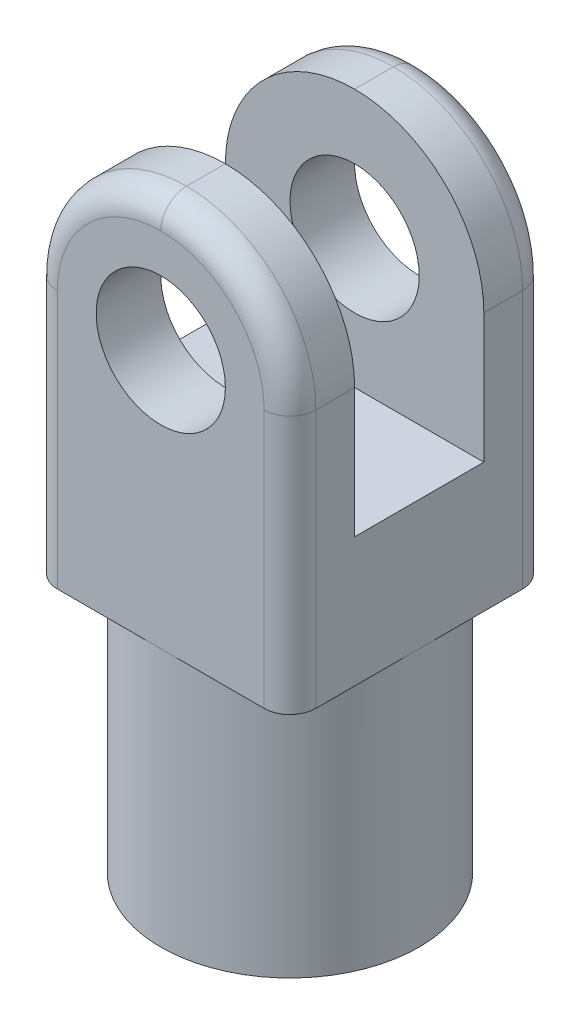
ISO-10303-21;
HEADER;
FILE_DESCRIPTION(('STEP AP214'),'2;1');
FILE_NAME('part.step','',(''),(''),'','','');
FILE_SCHEMA(('AUTOMOTIVE_DESIGN { 1 0 10303 214 1 1 1 1 }'));
ENDSEC;
DATA;
#1=APPLICATION_CONTEXT('core data for automotive mechanical design processes');
#2=APPLICATION_PROTOCOL_DEFINITION('international standard','automotive_design',2000,#1);
#3=PRODUCT_CONTEXT('',#1,'mechanical');
#4=PRODUCT('Part','Part','',(#3));
#5=PRODUCT_RELATED_PRODUCT_CATEGORY('part','',(#4));
#6=PRODUCT_DEFINITION_FORMATION('','',#4);
#7=PRODUCT_DEFINITION_CONTEXT('part definition',#1,'design');
#8=PRODUCT_DEFINITION('design','',#6,#7);
#9=PRODUCT_DEFINITION_SHAPE('','',#8);
#10=(LENGTH_UNIT() NAMED_UNIT(*) SI_UNIT(.MILLI.,.METRE.));
#11=(NAMED_UNIT(*) PLANE_ANGLE_UNIT() SI_UNIT($,.RADIAN.));
#12=(NAMED_UNIT(*) SI_UNIT($,.STERADIAN.) SOLID_ANGLE_UNIT());
#13=UNCERTAINTY_MEASURE_WITH_UNIT(LENGTH_MEASURE(1.E-05),#10,'distance_accuracy_value','');
#14=(GEOMETRIC_REPRESENTATION_CONTEXT(3) GLOBAL_UNCERTAINTY_ASSIGNED_CONTEXT((#13)) GLOBAL_UNIT_ASSIGNED_CONTEXT((#10,
#11,#12)) REPRESENTATION_CONTEXT('',''));
#15=CARTESIAN_POINT('',(0.,0.,0.));
#16=DIRECTION('',(0.,0.,1.));
#17=DIRECTION('',(1.,0.,0.));
#18=AXIS2_PLACEMENT_3D('',#15,#16,#17);
#19=CARTESIAN_POINT('',(0.,0.,0.));
#20=DIRECTION('',(0.,1.,0.));
#21=DIRECTION('',(0.,0.,1.));
#22=AXIS2_PLACEMENT_3D('',#19,#20,#21);
#23=PLANE('',#22);
#24=DIRECTION('',(-1.,0.,0.));
#25=VECTOR('',#24,1.);
#26=CARTESIAN_POINT('',(-50.,0.,-50.));
#27=LINE('',#26,#25);
#28=CARTESIAN_POINT('',(40.,0.,-50.));
#29=VERTEX_POINT('',#28);
#30=CARTESIAN_POINT('',(0.,0.,-50.));
#31=VERTEX_POINT('',#30);
#32=EDGE_CURVE('E224',#29,#31,#27,.T.);
#33=ORIENTED_EDGE('',*,*,#32,.F.);
#34=CARTESIAN_POINT('',(40.,0.,-40.));
#35=DIRECTION('',(0.,1.,0.));
#36=DIRECTION('',(0.,0.,1.));
#37=AXIS2_PLACEMENT_3D('',#34,#35,#36);
#38=CIRCLE('',#37,10.);
#39=CARTESIAN_POINT('',(50.,0.,-40.));
#40=VERTEX_POINT('',#39);
#41=EDGE_CURVE('E65',#29,#40,#38,.F.);
#42=ORIENTED_EDGE('',*,*,#41,.T.);
#43=DIRECTION('',(0.,0.,-1.));
#44=VECTOR('',#43,1.);
#45=CARTESIAN_POINT('',(50.,0.,-50.));
#46=LINE('',#45,#44);
#47=CARTESIAN_POINT('',(50.,0.,0.));
#48=VERTEX_POINT('',#47);
#49=EDGE_CURVE('E214',#48,#40,#46,.T.);
#50=ORIENTED_EDGE('',*,*,#49,.F.);
#51=CARTESIAN_POINT('',(0.,0.,0.));
#52=DIRECTION('',(0.,-1.,0.));
#53=DIRECTION('',(0.,0.,-1.));
#54=AXIS2_PLACEMENT_3D('',#51,#52,#53);
#55=CIRCLE('',#54,50.);
#56=EDGE_CURVE('E204',#31,#48,#55,.T.);
#57=ORIENTED_EDGE('',*,*,#56,.F.);
#58=EDGE_LOOP('',(#33,#42,#50,#57));
#59=FACE_BOUND('',#58,.T.);
#60=ADVANCED_FACE('F39',(#59),#23,.F.);
#61=CARTESIAN_POINT('',(50.,0.,40.));
#62=VERTEX_POINT('',#61);
#63=EDGE_CURVE('E220',#62,#48,#46,.T.);
#64=ORIENTED_EDGE('',*,*,#63,.F.);
#65=CARTESIAN_POINT('',(40.,0.,40.));
#66=DIRECTION('',(0.,1.,0.));
#67=DIRECTION('',(0.,0.,1.));
#68=AXIS2_PLACEMENT_3D('',#65,#66,#67);
#69=CIRCLE('',#68,10.);
#70=CARTESIAN_POINT('',(40.,0.,50.));
#71=VERTEX_POINT('',#70);
#72=EDGE_CURVE('E11',#62,#71,#69,.F.);
#73=ORIENTED_EDGE('',*,*,#72,.T.);
#74=DIRECTION('',(1.,0.,0.));
#75=VECTOR('',#74,1.);
#76=CARTESIAN_POINT('',(-50.,0.,50.));
#77=LINE('',#76,#75);
#78=CARTESIAN_POINT('',(0.,0.,50.));
#79=VERTEX_POINT('',#78);
#80=EDGE_CURVE('E231',#79,#71,#77,.T.);
#81=ORIENTED_EDGE('',*,*,#80,.F.);
#82=EDGE_CURVE('E218',#48,#79,#55,.T.);
#83=ORIENTED_EDGE('',*,*,#82,.F.);
#84=EDGE_LOOP('',(#64,#73,#81,#83));
#85=FACE_BOUND('',#84,.T.);
#86=ADVANCED_FACE('F363',(#85),#23,.F.);
#87=CARTESIAN_POINT('',(-40.,0.,50.));
#88=VERTEX_POINT('',#87);
#89=EDGE_CURVE('E232',#88,#79,#77,.T.);
#90=ORIENTED_EDGE('',*,*,#89,.F.);
#91=CARTESIAN_POINT('',(-40.,0.,40.));
#92=DIRECTION('',(0.,1.,0.));
#93=DIRECTION('',(0.,0.,1.));
#94=AXIS2_PLACEMENT_3D('',#91,#92,#93);
#95=CIRCLE('',#94,10.);
#96=CARTESIAN_POINT('',(-50.,0.,40.));
#97=VERTEX_POINT('',#96);
#98=EDGE_CURVE('E314',#88,#97,#95,.F.);
#99=ORIENTED_EDGE('',*,*,#98,.T.);
#100=DIRECTION('',(0.,0.,1.));
#101=VECTOR('',#100,1.);
#102=CARTESIAN_POINT('',(-50.,0.,-50.));
#103=LINE('',#102,#101);
#104=CARTESIAN_POINT('',(-50.,0.,0.));
#105=VERTEX_POINT('',#104);
#106=EDGE_CURVE('E227',#105,#97,#103,.T.);
#107=ORIENTED_EDGE('',*,*,#106,.F.);
#108=EDGE_CURVE('E665',#79,#105,#55,.T.);
#109=ORIENTED_EDGE('',*,*,#108,.F.);
#110=EDGE_LOOP('',(#90,#99,#107,#109));
#111=FACE_BOUND('',#110,.T.);
#112=ADVANCED_FACE('F421',(#111),#23,.F.);
#113=CARTESIAN_POINT('',(50.,150.,-50.));
#114=DIRECTION('',(-1.,0.,0.));
#115=DIRECTION('',(0.,0.,1.));
#116=AXIS2_PLACEMENT_3D('',#113,#114,#115);
#117=PLANE('',#116);
#118=ORIENTED_EDGE('',*,*,#49,.T.);
#119=DIRECTION('',(0.,-1.,0.));
#120=VECTOR('',#119,1.);
#121=CARTESIAN_POINT('',(50.,150.,-40.));
#122=LINE('',#121,#120);
#123=CARTESIAN_POINT('',(50.,100.,-40.));
#124=VERTEX_POINT('',#123);
#125=EDGE_CURVE('E49',#40,#124,#122,.F.);
#126=ORIENTED_EDGE('',*,*,#125,.T.);
#127=DIRECTION('',(0.,0.,-1.));
#128=VECTOR('',#127,1.);
#129=CARTESIAN_POINT('',(50.,100.,-25.));
#130=LINE('',#129,#128);
#131=CARTESIAN_POINT('',(50.,100.,-25.));
#132=VERTEX_POINT('',#131);
#133=EDGE_CURVE('E246',#124,#132,#130,.F.);
#134=ORIENTED_EDGE('',*,*,#133,.T.);
#135=DIRECTION('',(0.,1.,0.));
#136=VECTOR('',#135,1.);
#137=CARTESIAN_POINT('',(50.,50.,-25.));
#138=LINE('',#137,#136);
#139=CARTESIAN_POINT('',(50.,50.,-25.));
#140=VERTEX_POINT('',#139);
#141=EDGE_CURVE('E195',#140,#132,#138,.T.);
#142=ORIENTED_EDGE('',*,*,#141,.F.);
#143=DIRECTION('',(0.,0.,-1.));
#144=VECTOR('',#143,1.);
#145=CARTESIAN_POINT('',(50.,50.,-25.));
#146=LINE('',#145,#144);
#147=CARTESIAN_POINT('',(50.,50.,25.));
#148=VERTEX_POINT('',#147);
#149=EDGE_CURVE('E174',#148,#140,#146,.T.);
#150=ORIENTED_EDGE('',*,*,#149,.F.);
#151=DIRECTION('',(0.,1.,0.));
#152=VECTOR('',#151,1.);
#153=CARTESIAN_POINT('',(50.,50.,25.));
#154=LINE('',#153,#152);
#155=CARTESIAN_POINT('',(50.,100.,25.));
#156=VERTEX_POINT('',#155);
#157=EDGE_CURVE('E170',#148,#156,#154,.T.);
#158=ORIENTED_EDGE('',*,*,#157,.T.);
#159=DIRECTION('',(0.,0.,-1.));
#160=VECTOR('',#159,1.);
#161=CARTESIAN_POINT('',(50.,100.,50.));
#162=LINE('',#161,#160);
#163=CARTESIAN_POINT('',(50.,100.,40.));
#164=VERTEX_POINT('',#163);
#165=EDGE_CURVE('E249',#156,#164,#162,.F.);
#166=ORIENTED_EDGE('',*,*,#165,.T.);
#167=DIRECTION('',(0.,-1.,0.));
#168=VECTOR('',#167,1.);
#169=CARTESIAN_POINT('',(50.,150.,40.));
#170=LINE('',#169,#168);
#171=EDGE_CURVE('E57',#164,#62,#170,.T.);
#172=ORIENTED_EDGE('',*,*,#171,.T.);
#173=ORIENTED_EDGE('',*,*,#63,.T.);
#174=EDGE_LOOP('',(#118,#126,#134,#142,#150,#158,#166,#172,#173));
#175=FACE_BOUND('',#174,.T.);
#176=ADVANCED_FACE('F467',(#175),#117,.F.);
#177=CARTESIAN_POINT('',(-50.,150.,-50.));
#178=DIRECTION('',(0.,0.,1.));
#179=DIRECTION('',(1.,0.,0.));
#180=AXIS2_PLACEMENT_3D('',#177,#178,#179);
#181=PLANE('',#180);
#182=CARTESIAN_POINT('',(0.,100.,-50.));
#183=DIRECTION('',(0.,0.,1.));
#184=DIRECTION('',(1.,0.,0.));
#185=AXIS2_PLACEMENT_3D('',#182,#183,#184);
#186=CIRCLE('',#185,25.);
#187=CARTESIAN_POINT('',(25.,100.,-50.));
#188=VERTEX_POINT('',#187);
#189=EDGE_CURVE('E239',#188,#188,#186,.T.);
#190=ORIENTED_EDGE('',*,*,#189,.T.);
#191=EDGE_LOOP('',(#190));
#192=FACE_BOUND('',#191,.T.);
#193=CARTESIAN_POINT('',(-40.,0.,-50.));
#194=VERTEX_POINT('',#193);
#195=EDGE_CURVE('E223',#31,#194,#27,.T.);
#196=ORIENTED_EDGE('',*,*,#195,.T.);
#197=DIRECTION('',(0.,-1.,0.));
#198=VECTOR('',#197,1.);
#199=CARTESIAN_POINT('',(-40.,150.,-50.));
#200=LINE('',#199,#198);
#201=CARTESIAN_POINT('',(-40.,100.,-50.));
#202=VERTEX_POINT('',#201);
#203=EDGE_CURVE('E292',#194,#202,#200,.F.);
#204=ORIENTED_EDGE('',*,*,#203,.T.);
#205=CARTESIAN_POINT('',(0.,100.,-50.));
#206=DIRECTION('',(0.,0.,1.));
#207=DIRECTION('',(1.,0.,0.));
#208=AXIS2_PLACEMENT_3D('',#205,#206,#207);
#209=CIRCLE('',#208,40.);
#210=CARTESIAN_POINT('',(0.,140.,-50.));
#211=VERTEX_POINT('',#210);
#212=EDGE_CURVE('E289',#202,#211,#209,.F.);
#213=ORIENTED_EDGE('',*,*,#212,.T.);
#214=CARTESIAN_POINT('',(0.,100.,-50.));
#215=DIRECTION('',(0.,0.,1.));
#216=DIRECTION('',(1.,0.,0.));
#217=AXIS2_PLACEMENT_3D('',#214,#215,#216);
#218=CIRCLE('',#217,40.);
#219=CARTESIAN_POINT('',(40.,100.,-50.));
#220=VERTEX_POINT('',#219);
#221=EDGE_CURVE('E286',#211,#220,#218,.F.);
#222=ORIENTED_EDGE('',*,*,#221,.T.);
#223=DIRECTION('',(0.,-1.,0.));
#224=VECTOR('',#223,1.);
#225=CARTESIAN_POINT('',(40.,150.,-50.));
#226=LINE('',#225,#224);
#227=EDGE_CURVE('E283',#220,#29,#226,.T.);
#228=ORIENTED_EDGE('',*,*,#227,.T.);
#229=ORIENTED_EDGE('',*,*,#32,.T.);
#230=EDGE_LOOP('',(#196,#204,#213,#222,#228,#229));
#231=FACE_BOUND('',#230,.T.);
#232=ADVANCED_FACE('F396',(#192,#231),#181,.F.);
#233=CARTESIAN_POINT('',(-50.,150.,-50.));
#234=DIRECTION('',(1.,0.,0.));
#235=DIRECTION('',(0.,0.,-1.));
#236=AXIS2_PLACEMENT_3D('',#233,#234,#235);
#237=PLANE('',#236);
#238=DIRECTION('',(0.,0.,1.));
#239=VECTOR('',#238,1.);
#240=CARTESIAN_POINT('',(-50.,100.,-50.));
#241=LINE('',#240,#239);
#242=CARTESIAN_POINT('',(-50.,100.,-25.));
#243=VERTEX_POINT('',#242);
#244=CARTESIAN_POINT('',(-50.,100.,-40.));
#245=VERTEX_POINT('',#244);
#246=EDGE_CURVE('E261',#243,#245,#241,.F.);
#247=ORIENTED_EDGE('',*,*,#246,.T.);
#248=DIRECTION('',(0.,-1.,0.));
#249=VECTOR('',#248,1.);
#250=CARTESIAN_POINT('',(-50.,150.,-40.));
#251=LINE('',#250,#249);
#252=CARTESIAN_POINT('',(-50.,0.,-40.));
#253=VERTEX_POINT('',#252);
#254=EDGE_CURVE('E276',#245,#253,#251,.T.);
#255=ORIENTED_EDGE('',*,*,#254,.T.);
#256=EDGE_CURVE('E228',#253,#105,#103,.T.);
#257=ORIENTED_EDGE('',*,*,#256,.T.);
#258=ORIENTED_EDGE('',*,*,#106,.T.);
#259=DIRECTION('',(0.,-1.,0.));
#260=VECTOR('',#259,1.);
#261=CARTESIAN_POINT('',(-50.,150.,40.));
#262=LINE('',#261,#260);
#263=CARTESIAN_POINT('',(-50.,100.,40.));
#264=VERTEX_POINT('',#263);
#265=EDGE_CURVE('E264',#97,#264,#262,.F.);
#266=ORIENTED_EDGE('',*,*,#265,.T.);
#267=DIRECTION('',(0.,0.,1.));
#268=VECTOR('',#267,1.);
#269=CARTESIAN_POINT('',(-50.,100.,25.));
#270=LINE('',#269,#268);
#271=CARTESIAN_POINT('',(-50.,100.,25.));
#272=VERTEX_POINT('',#271);
#273=EDGE_CURVE('E190',#264,#272,#270,.F.);
#274=ORIENTED_EDGE('',*,*,#273,.T.);
#275=DIRECTION('',(0.,1.,0.));
#276=VECTOR('',#275,1.);
#277=CARTESIAN_POINT('',(-50.,50.,25.));
#278=LINE('',#277,#276);
#279=CARTESIAN_POINT('',(-50.,50.,25.));
#280=VERTEX_POINT('',#279);
#281=EDGE_CURVE('E167',#280,#272,#278,.T.);
#282=ORIENTED_EDGE('',*,*,#281,.F.);
#283=DIRECTION('',(0.,0.,1.));
#284=VECTOR('',#283,1.);
#285=CARTESIAN_POINT('',(-50.,50.,-25.));
#286=LINE('',#285,#284);
#287=CARTESIAN_POINT('',(-50.,50.,-25.));
#288=VERTEX_POINT('',#287);
#289=EDGE_CURVE('E175',#288,#280,#286,.T.);
#290=ORIENTED_EDGE('',*,*,#289,.F.);
#291=DIRECTION('',(0.,1.,0.));
#292=VECTOR('',#291,1.);
#293=CARTESIAN_POINT('',(-50.,50.,-25.));
#294=LINE('',#293,#292);
#295=EDGE_CURVE('E209',#288,#243,#294,.T.);
#296=ORIENTED_EDGE('',*,*,#295,.T.);
#297=EDGE_LOOP('',(#247,#255,#257,#258,#266,#274,#282,#290,#296));
#298=FACE_BOUND('',#297,.T.);
#299=ADVANCED_FACE('F188',(#298),#237,.F.);
#300=CARTESIAN_POINT('',(-50.,150.,50.));
#301=DIRECTION('',(0.,0.,-1.));
#302=DIRECTION('',(-1.,0.,0.));
#303=AXIS2_PLACEMENT_3D('',#300,#301,#302);
#304=PLANE('',#303);
#305=CARTESIAN_POINT('',(0.,100.,50.));
#306=DIRECTION('',(0.,0.,1.));
#307=DIRECTION('',(1.,0.,0.));
#308=AXIS2_PLACEMENT_3D('',#305,#306,#307);
#309=CIRCLE('',#308,25.);
#310=CARTESIAN_POINT('',(25.,100.,50.));
#311=VERTEX_POINT('',#310);
#312=EDGE_CURVE('E269',#311,#311,#309,.T.);
#313=ORIENTED_EDGE('',*,*,#312,.F.);
#314=EDGE_LOOP('',(#313));
#315=FACE_BOUND('',#314,.T.);
#316=CARTESIAN_POINT('',(0.,100.,50.));
#317=DIRECTION('',(0.,0.,-1.));
#318=DIRECTION('',(-1.,0.,0.));
#319=AXIS2_PLACEMENT_3D('',#316,#317,#318);
#320=CIRCLE('',#319,40.);
#321=CARTESIAN_POINT('',(0.,140.,50.));
#322=VERTEX_POINT('',#321);
#323=CARTESIAN_POINT('',(-40.,100.,50.));
#324=VERTEX_POINT('',#323);
#325=EDGE_CURVE('E307',#322,#324,#320,.F.);
#326=ORIENTED_EDGE('',*,*,#325,.T.);
#327=DIRECTION('',(0.,-1.,0.));
#328=VECTOR('',#327,1.);
#329=CARTESIAN_POINT('',(-40.,150.,50.));
#330=LINE('',#329,#328);
#331=EDGE_CURVE('E310',#324,#88,#330,.T.);
#332=ORIENTED_EDGE('',*,*,#331,.T.);
#333=ORIENTED_EDGE('',*,*,#89,.T.);
#334=ORIENTED_EDGE('',*,*,#80,.T.);
#335=DIRECTION('',(0.,-1.,0.));
#336=VECTOR('',#335,1.);
#337=CARTESIAN_POINT('',(40.,150.,50.));
#338=LINE('',#337,#336);
#339=CARTESIAN_POINT('',(40.,100.,50.));
#340=VERTEX_POINT('',#339);
#341=EDGE_CURVE('E301',#71,#340,#338,.F.);
#342=ORIENTED_EDGE('',*,*,#341,.T.);
#343=CARTESIAN_POINT('',(0.,100.,50.));
#344=DIRECTION('',(0.,0.,-1.));
#345=DIRECTION('',(-1.,0.,0.));
#346=AXIS2_PLACEMENT_3D('',#343,#344,#345);
#347=CIRCLE('',#346,40.);
#348=EDGE_CURVE('E304',#340,#322,#347,.F.);
#349=ORIENTED_EDGE('',*,*,#348,.T.);
#350=EDGE_LOOP('',(#326,#332,#333,#334,#342,#349));
#351=FACE_BOUND('',#350,.T.);
#352=ADVANCED_FACE('F367',(#315,#351),#304,.F.);
#353=ORIENTED_EDGE('',*,*,#256,.F.);
#354=CARTESIAN_POINT('',(-40.,0.,-40.));
#355=DIRECTION('',(0.,1.,0.));
#356=DIRECTION('',(0.,0.,1.));
#357=AXIS2_PLACEMENT_3D('',#354,#355,#356);
#358=CIRCLE('',#357,10.);
#359=EDGE_CURVE('E280',#253,#194,#358,.F.);
#360=ORIENTED_EDGE('',*,*,#359,.T.);
#361=ORIENTED_EDGE('',*,*,#195,.F.);
#362=EDGE_CURVE('E219',#105,#31,#55,.T.);
#363=ORIENTED_EDGE('',*,*,#362,.F.);
#364=EDGE_LOOP('',(#353,#360,#361,#363));
#365=FACE_BOUND('',#364,.T.);
#366=ADVANCED_FACE('F420',(#365),#23,.F.);
#367=CARTESIAN_POINT('',(0.,-100.,0.));
#368=DIRECTION('',(0.,-1.,0.));
#369=DIRECTION('',(0.,0.,-1.));
#370=AXIS2_PLACEMENT_3D('',#367,#368,#369);
#371=PLANE('',#370);
#372=CARTESIAN_POINT('',(0.,-100.,0.));
#373=DIRECTION('',(0.,-1.,0.));
#374=DIRECTION('',(0.,0.,-1.));
#375=AXIS2_PLACEMENT_3D('',#372,#373,#374);
#376=CIRCLE('',#375,50.);
#377=CARTESIAN_POINT('',(0.,-100.,-50.));
#378=VERTEX_POINT('',#377);
#379=EDGE_CURVE('E210',#378,#378,#376,.T.);
#380=ORIENTED_EDGE('',*,*,#379,.T.);
#381=EDGE_LOOP('',(#380));
#382=FACE_BOUND('',#381,.T.);
#383=CARTESIAN_POINT('',(0.,-100.,0.));
#384=DIRECTION('',(0.,-1.,0.));
#385=DIRECTION('',(0.,0.,-1.));
#386=AXIS2_PLACEMENT_3D('',#383,#384,#385);
#387=CIRCLE('',#386,25.);
#388=CARTESIAN_POINT('',(0.,-100.,-25.));
#389=VERTEX_POINT('',#388);
#390=EDGE_CURVE('E200',#389,#389,#387,.T.);
#391=ORIENTED_EDGE('',*,*,#390,.F.);
#392=EDGE_LOOP('',(#391));
#393=FACE_BOUND('',#392,.T.);
#394=ADVANCED_FACE('F430',(#382,#393),#371,.T.);
#395=CARTESIAN_POINT('',(0.,-100.,0.));
#396=DIRECTION('',(0.,1.,0.));
#397=DIRECTION('',(0.,0.,1.));
#398=AXIS2_PLACEMENT_3D('',#395,#396,#397);
#399=CYLINDRICAL_SURFACE('',#398,50.);
#400=ORIENTED_EDGE('',*,*,#379,.F.);
#401=EDGE_LOOP('',(#400));
#402=FACE_BOUND('',#401,.T.);
#403=ORIENTED_EDGE('',*,*,#56,.T.);
#404=ORIENTED_EDGE('',*,*,#82,.T.);
#405=ORIENTED_EDGE('',*,*,#108,.T.);
#406=ORIENTED_EDGE('',*,*,#362,.T.);
#407=EDGE_LOOP('',(#403,#404,#405,#406));
#408=FACE_BOUND('',#407,.T.);
#409=ADVANCED_FACE('F436',(#402,#408),#399,.T.);
#410=CARTESIAN_POINT('',(0.,-100.,0.));
#411=DIRECTION('',(0.,1.,0.));
#412=DIRECTION('',(0.,0.,1.));
#413=AXIS2_PLACEMENT_3D('',#410,#411,#412);
#414=CYLINDRICAL_SURFACE('',#413,25.);
#415=ORIENTED_EDGE('',*,*,#390,.T.);
#416=EDGE_LOOP('',(#415));
#417=FACE_BOUND('',#416,.T.);
#418=CARTESIAN_POINT('',(0.,0.,0.));
#419=DIRECTION('',(0.,-1.,0.));
#420=DIRECTION('',(0.,0.,-1.));
#421=AXIS2_PLACEMENT_3D('',#418,#419,#420);
#422=CIRCLE('',#421,25.);
#423=CARTESIAN_POINT('',(0.,0.,-25.));
#424=VERTEX_POINT('',#423);
#425=EDGE_CURVE('E205',#424,#424,#422,.T.);
#426=ORIENTED_EDGE('',*,*,#425,.F.);
#427=EDGE_LOOP('',(#426));
#428=FACE_BOUND('',#427,.T.);
#429=ADVANCED_FACE('F417',(#417,#428),#414,.F.);
#430=ORIENTED_EDGE('',*,*,#425,.T.);
#431=EDGE_LOOP('',(#430));
#432=FACE_BOUND('',#431,.T.);
#433=ADVANCED_FACE('F409',(#432),#23,.F.);
#434=CARTESIAN_POINT('',(-50.,50.,-25.));
#435=DIRECTION('',(0.,0.,-1.));
#436=DIRECTION('',(-1.,0.,0.));
#437=AXIS2_PLACEMENT_3D('',#434,#435,#436);
#438=PLANE('',#437);
#439=CARTESIAN_POINT('',(0.,100.,-25.));
#440=DIRECTION('',(0.,0.,-1.));
#441=DIRECTION('',(-1.,0.,0.));
#442=AXIS2_PLACEMENT_3D('',#439,#440,#441);
#443=CIRCLE('',#442,25.);
#444=CARTESIAN_POINT('',(-25.,100.,-25.));
#445=VERTEX_POINT('',#444);
#446=EDGE_CURVE('E185',#445,#445,#443,.T.);
#447=ORIENTED_EDGE('',*,*,#446,.T.);
#448=EDGE_LOOP('',(#447));
#449=FACE_BOUND('',#448,.T.);
#450=ORIENTED_EDGE('',*,*,#141,.T.);
#451=CARTESIAN_POINT('',(0.,100.,-25.));
#452=DIRECTION('',(0.,0.,-1.));
#453=DIRECTION('',(-1.,0.,0.));
#454=AXIS2_PLACEMENT_3D('',#451,#452,#453);
#455=CIRCLE('',#454,50.);
#456=CARTESIAN_POINT('',(0.,150.,-25.));
#457=VERTEX_POINT('',#456);
#458=EDGE_CURVE('E255',#132,#457,#455,.F.);
#459=ORIENTED_EDGE('',*,*,#458,.T.);
#460=CARTESIAN_POINT('',(0.,100.,-25.));
#461=DIRECTION('',(0.,0.,-1.));
#462=DIRECTION('',(-1.,0.,0.));
#463=AXIS2_PLACEMENT_3D('',#460,#461,#462);
#464=CIRCLE('',#463,50.);
#465=EDGE_CURVE('E252',#457,#243,#464,.F.);
#466=ORIENTED_EDGE('',*,*,#465,.T.);
#467=ORIENTED_EDGE('',*,*,#295,.F.);
#468=DIRECTION('',(-1.,0.,0.));
#469=VECTOR('',#468,1.);
#470=CARTESIAN_POINT('',(-50.,50.,-25.));
#471=LINE('',#470,#469);
#472=EDGE_CURVE('E181',#140,#288,#471,.T.);
#473=ORIENTED_EDGE('',*,*,#472,.F.);
#474=EDGE_LOOP('',(#450,#459,#466,#467,#473));
#475=FACE_BOUND('',#474,.T.);
#476=ADVANCED_FACE('F407',(#449,#475),#438,.F.);
#477=CARTESIAN_POINT('',(-50.,50.,25.));
#478=DIRECTION('',(0.,0.,1.));
#479=DIRECTION('',(1.,0.,0.));
#480=AXIS2_PLACEMENT_3D('',#477,#478,#479);
#481=PLANE('',#480);
#482=CARTESIAN_POINT('',(0.,100.,25.));
#483=DIRECTION('',(0.,0.,1.));
#484=DIRECTION('',(1.,0.,0.));
#485=AXIS2_PLACEMENT_3D('',#482,#483,#484);
#486=CIRCLE('',#485,25.);
#487=CARTESIAN_POINT('',(25.,100.,25.));
#488=VERTEX_POINT('',#487);
#489=EDGE_CURVE('E235',#488,#488,#486,.T.);
#490=ORIENTED_EDGE('',*,*,#489,.T.);
#491=EDGE_LOOP('',(#490));
#492=FACE_BOUND('',#491,.T.);
#493=CARTESIAN_POINT('',(0.,100.,25.));
#494=DIRECTION('',(0.,0.,1.));
#495=DIRECTION('',(1.,0.,0.));
#496=AXIS2_PLACEMENT_3D('',#493,#494,#495);
#497=CIRCLE('',#496,50.);
#498=CARTESIAN_POINT('',(0.,150.,25.));
#499=VERTEX_POINT('',#498);
#500=EDGE_CURVE('E240',#272,#499,#497,.F.);
#501=ORIENTED_EDGE('',*,*,#500,.T.);
#502=CARTESIAN_POINT('',(0.,100.,25.));
#503=DIRECTION('',(0.,0.,1.));
#504=DIRECTION('',(1.,0.,0.));
#505=AXIS2_PLACEMENT_3D('',#502,#503,#504);
#506=CIRCLE('',#505,50.);
#507=EDGE_CURVE('E243',#499,#156,#506,.F.);
#508=ORIENTED_EDGE('',*,*,#507,.T.);
#509=ORIENTED_EDGE('',*,*,#157,.F.);
#510=DIRECTION('',(1.,0.,0.));
#511=VECTOR('',#510,1.);
#512=CARTESIAN_POINT('',(-50.,50.,25.));
#513=LINE('',#512,#511);
#514=EDGE_CURVE('E163',#280,#148,#513,.T.);
#515=ORIENTED_EDGE('',*,*,#514,.F.);
#516=ORIENTED_EDGE('',*,*,#281,.T.);
#517=EDGE_LOOP('',(#501,#508,#509,#515,#516));
#518=FACE_BOUND('',#517,.T.);
#519=ADVANCED_FACE('F165',(#492,#518),#481,.F.);
#520=CARTESIAN_POINT('',(0.,50.,0.));
#521=DIRECTION('',(0.,1.,0.));
#522=DIRECTION('',(0.,0.,1.));
#523=AXIS2_PLACEMENT_3D('',#520,#521,#522);
#524=PLANE('',#523);
#525=ORIENTED_EDGE('',*,*,#289,.T.);
#526=ORIENTED_EDGE('',*,*,#514,.T.);
#527=ORIENTED_EDGE('',*,*,#149,.T.);
#528=ORIENTED_EDGE('',*,*,#472,.T.);
#529=EDGE_LOOP('',(#525,#526,#527,#528));
#530=FACE_BOUND('',#529,.T.);
#531=ADVANCED_FACE('F179',(#530),#524,.T.);
#532=CARTESIAN_POINT('',(0.,100.,-50.));
#533=DIRECTION('',(0.,0.,1.));
#534=DIRECTION('',(1.,0.,0.));
#535=AXIS2_PLACEMENT_3D('',#532,#533,#534);
#536=CYLINDRICAL_SURFACE('',#535,25.);
#537=ORIENTED_EDGE('',*,*,#312,.T.);
#538=EDGE_LOOP('',(#537));
#539=FACE_BOUND('',#538,.T.);
#540=ORIENTED_EDGE('',*,*,#489,.F.);
#541=EDGE_LOOP('',(#540));
#542=FACE_BOUND('',#541,.T.);
#543=ADVANCED_FACE('F403',(#539,#542),#536,.F.);
#544=ORIENTED_EDGE('',*,*,#189,.F.);
#545=EDGE_LOOP('',(#544));
#546=FACE_BOUND('',#545,.T.);
#547=ORIENTED_EDGE('',*,*,#446,.F.);
#548=EDGE_LOOP('',(#547));
#549=FACE_BOUND('',#548,.T.);
#550=ADVANCED_FACE('F399',(#546,#549),#536,.F.);
#551=CARTESIAN_POINT('',(0.,100.,0.));
#552=DIRECTION('',(0.,0.,-1.));
#553=DIRECTION('',(-1.,0.,0.));
#554=AXIS2_PLACEMENT_3D('',#551,#552,#553);
#555=CYLINDRICAL_SURFACE('',#554,50.);
#556=ORIENTED_EDGE('',*,*,#273,.F.);
#557=CARTESIAN_POINT('',(0.,100.,40.));
#558=DIRECTION('',(0.,0.,-1.));
#559=DIRECTION('',(-1.,0.,0.));
#560=AXIS2_PLACEMENT_3D('',#557,#558,#559);
#561=CIRCLE('',#560,50.);
#562=CARTESIAN_POINT('',(0.,150.,40.));
#563=VERTEX_POINT('',#562);
#564=EDGE_CURVE('E317',#264,#563,#561,.T.);
#565=ORIENTED_EDGE('',*,*,#564,.T.);
#566=DIRECTION('',(0.,0.,1.));
#567=VECTOR('',#566,1.);
#568=CARTESIAN_POINT('',(0.,150.,50.));
#569=LINE('',#568,#567);
#570=EDGE_CURVE('E265',#499,#563,#569,.T.);
#571=ORIENTED_EDGE('',*,*,#570,.F.);
#572=ORIENTED_EDGE('',*,*,#500,.F.);
#573=EDGE_LOOP('',(#556,#565,#571,#572));
#574=FACE_BOUND('',#573,.T.);
#575=ADVANCED_FACE('F402',(#574),#555,.T.);
#576=CARTESIAN_POINT('',(0.,100.,0.));
#577=DIRECTION('',(0.,0.,1.));
#578=DIRECTION('',(1.,0.,0.));
#579=AXIS2_PLACEMENT_3D('',#576,#577,#578);
#580=CYLINDRICAL_SURFACE('',#579,50.);
#581=ORIENTED_EDGE('',*,*,#570,.T.);
#582=CARTESIAN_POINT('',(0.,100.,40.));
#583=DIRECTION('',(0.,0.,-1.));
#584=DIRECTION('',(-1.,0.,0.));
#585=AXIS2_PLACEMENT_3D('',#582,#583,#584);
#586=CIRCLE('',#585,50.);
#587=EDGE_CURVE('E320',#563,#164,#586,.T.);
#588=ORIENTED_EDGE('',*,*,#587,.T.);
#589=ORIENTED_EDGE('',*,*,#165,.F.);
#590=ORIENTED_EDGE('',*,*,#507,.F.);
#591=EDGE_LOOP('',(#581,#588,#589,#590));
#592=FACE_BOUND('',#591,.T.);
#593=ADVANCED_FACE('F476',(#592),#580,.T.);
#594=CARTESIAN_POINT('',(0.,100.,0.));
#595=DIRECTION('',(0.,0.,-1.));
#596=DIRECTION('',(-1.,0.,0.));
#597=AXIS2_PLACEMENT_3D('',#594,#595,#596);
#598=CYLINDRICAL_SURFACE('',#597,50.);
#599=DIRECTION('',(0.,0.,1.));
#600=VECTOR('',#599,1.);
#601=CARTESIAN_POINT('',(0.,150.,-25.));
#602=LINE('',#601,#600);
#603=CARTESIAN_POINT('',(0.,150.,-40.));
#604=VERTEX_POINT('',#603);
#605=EDGE_CURVE('E270',#604,#457,#602,.T.);
#606=ORIENTED_EDGE('',*,*,#605,.F.);
#607=CARTESIAN_POINT('',(0.,100.,-40.));
#608=DIRECTION('',(0.,0.,1.));
#609=DIRECTION('',(1.,0.,0.));
#610=AXIS2_PLACEMENT_3D('',#607,#608,#609);
#611=CIRCLE('',#610,50.);
#612=EDGE_CURVE('E295',#604,#245,#611,.T.);
#613=ORIENTED_EDGE('',*,*,#612,.T.);
#614=ORIENTED_EDGE('',*,*,#246,.F.);
#615=ORIENTED_EDGE('',*,*,#465,.F.);
#616=EDGE_LOOP('',(#606,#613,#614,#615));
#617=FACE_BOUND('',#616,.T.);
#618=ADVANCED_FACE('F474',(#617),#598,.T.);
#619=CARTESIAN_POINT('',(0.,100.,0.));
#620=DIRECTION('',(0.,0.,1.));
#621=DIRECTION('',(1.,0.,0.));
#622=AXIS2_PLACEMENT_3D('',#619,#620,#621);
#623=CYLINDRICAL_SURFACE('',#622,50.);
#624=ORIENTED_EDGE('',*,*,#133,.F.);
#625=CARTESIAN_POINT('',(0.,100.,-40.));
#626=DIRECTION('',(0.,0.,1.));
#627=DIRECTION('',(1.,0.,0.));
#628=AXIS2_PLACEMENT_3D('',#625,#626,#627);
#629=CIRCLE('',#628,50.);
#630=EDGE_CURVE('E298',#124,#604,#629,.T.);
#631=ORIENTED_EDGE('',*,*,#630,.T.);
#632=ORIENTED_EDGE('',*,*,#605,.T.);
#633=ORIENTED_EDGE('',*,*,#458,.F.);
#634=EDGE_LOOP('',(#624,#631,#632,#633));
#635=FACE_BOUND('',#634,.T.);
#636=ADVANCED_FACE('F470',(#635),#623,.T.);
#637=CARTESIAN_POINT('',(40.,150.,-40.));
#638=DIRECTION('',(0.,-1.,0.));
#639=DIRECTION('',(0.,0.,-1.));
#640=AXIS2_PLACEMENT_3D('',#637,#638,#639);
#641=CYLINDRICAL_SURFACE('',#640,10.);
#642=ORIENTED_EDGE('',*,*,#41,.F.);
#643=ORIENTED_EDGE('',*,*,#227,.F.);
#644=CARTESIAN_POINT('',(40.,100.,-40.));
#645=DIRECTION('',(0.,1.,0.));
#646=DIRECTION('',(0.,0.,1.));
#647=AXIS2_PLACEMENT_3D('',#644,#645,#646);
#648=CIRCLE('',#647,10.);
#649=EDGE_CURVE('E273',#124,#220,#648,.T.);
#650=ORIENTED_EDGE('',*,*,#649,.F.);
#651=ORIENTED_EDGE('',*,*,#125,.F.);
#652=EDGE_LOOP('',(#642,#643,#650,#651));
#653=FACE_BOUND('',#652,.T.);
#654=ADVANCED_FACE('F464',(#653),#641,.T.);
#655=CARTESIAN_POINT('',(0.,100.,-40.));
#656=DIRECTION('',(0.,0.,1.));
#657=DIRECTION('',(1.,0.,0.));
#658=AXIS2_PLACEMENT_3D('',#655,#656,#657);
#659=TOROIDAL_SURFACE('',#658,40.,10.);
#660=ORIENTED_EDGE('',*,*,#649,.T.);
#661=ORIENTED_EDGE('',*,*,#221,.F.);
#662=CARTESIAN_POINT('',(0.,140.,-40.));
#663=DIRECTION('',(-1.,0.,0.));
#664=DIRECTION('',(0.,0.,1.));
#665=AXIS2_PLACEMENT_3D('',#662,#663,#664);
#666=CIRCLE('',#665,10.);
#667=EDGE_CURVE('E333',#604,#211,#666,.T.);
#668=ORIENTED_EDGE('',*,*,#667,.F.);
#669=ORIENTED_EDGE('',*,*,#630,.F.);
#670=EDGE_LOOP('',(#660,#661,#668,#669));
#671=FACE_BOUND('',#670,.T.);
#672=ADVANCED_FACE('F460',(#671),#659,.T.);
#673=CARTESIAN_POINT('',(0.,100.,-40.));
#674=DIRECTION('',(0.,0.,1.));
#675=DIRECTION('',(1.,0.,0.));
#676=AXIS2_PLACEMENT_3D('',#673,#674,#675);
#677=TOROIDAL_SURFACE('',#676,40.,10.);
#678=ORIENTED_EDGE('',*,*,#667,.T.);
#679=ORIENTED_EDGE('',*,*,#212,.F.);
#680=CARTESIAN_POINT('',(-40.,100.,-40.));
#681=DIRECTION('',(0.,-1.,0.));
#682=DIRECTION('',(0.,0.,-1.));
#683=AXIS2_PLACEMENT_3D('',#680,#681,#682);
#684=CIRCLE('',#683,10.);
#685=EDGE_CURVE('E329',#245,#202,#684,.T.);
#686=ORIENTED_EDGE('',*,*,#685,.F.);
#687=ORIENTED_EDGE('',*,*,#612,.F.);
#688=EDGE_LOOP('',(#678,#679,#686,#687));
#689=FACE_BOUND('',#688,.T.);
#690=ADVANCED_FACE('F455',(#689),#677,.T.);
#691=CARTESIAN_POINT('',(-40.,150.,-40.));
#692=DIRECTION('',(0.,-1.,0.));
#693=DIRECTION('',(0.,0.,-1.));
#694=AXIS2_PLACEMENT_3D('',#691,#692,#693);
#695=CYLINDRICAL_SURFACE('',#694,10.);
#696=ORIENTED_EDGE('',*,*,#685,.T.);
#697=ORIENTED_EDGE('',*,*,#203,.F.);
#698=ORIENTED_EDGE('',*,*,#359,.F.);
#699=ORIENTED_EDGE('',*,*,#254,.F.);
#700=EDGE_LOOP('',(#696,#697,#698,#699));
#701=FACE_BOUND('',#700,.T.);
#702=ADVANCED_FACE('F450',(#701),#695,.T.);
#703=CARTESIAN_POINT('',(40.,150.,40.));
#704=DIRECTION('',(0.,-1.,0.));
#705=DIRECTION('',(0.,0.,-1.));
#706=AXIS2_PLACEMENT_3D('',#703,#704,#705);
#707=CYLINDRICAL_SURFACE('',#706,10.);
#708=ORIENTED_EDGE('',*,*,#72,.F.);
#709=ORIENTED_EDGE('',*,*,#171,.F.);
#710=CARTESIAN_POINT('',(40.,100.,40.));
#711=DIRECTION('',(0.,1.,0.));
#712=DIRECTION('',(0.,0.,1.));
#713=AXIS2_PLACEMENT_3D('',#710,#711,#712);
#714=CIRCLE('',#713,10.);
#715=EDGE_CURVE('E43',#340,#164,#714,.T.);
#716=ORIENTED_EDGE('',*,*,#715,.F.);
#717=ORIENTED_EDGE('',*,*,#341,.F.);
#718=EDGE_LOOP('',(#708,#709,#716,#717));
#719=FACE_BOUND('',#718,.T.);
#720=ADVANCED_FACE('F41',(#719),#707,.T.);
#721=CARTESIAN_POINT('',(0.,100.,40.));
#722=DIRECTION('',(0.,0.,-1.));
#723=DIRECTION('',(-1.,0.,0.));
#724=AXIS2_PLACEMENT_3D('',#721,#722,#723);
#725=TOROIDAL_SURFACE('',#724,40.,10.);
#726=ORIENTED_EDGE('',*,*,#715,.T.);
#727=ORIENTED_EDGE('',*,*,#587,.F.);
#728=CARTESIAN_POINT('',(0.,140.,40.));
#729=DIRECTION('',(-1.,0.,0.));
#730=DIRECTION('',(0.,0.,1.));
#731=AXIS2_PLACEMENT_3D('',#728,#729,#730);
#732=CIRCLE('',#731,10.);
#733=EDGE_CURVE('E343',#322,#563,#732,.T.);
#734=ORIENTED_EDGE('',*,*,#733,.F.);
#735=ORIENTED_EDGE('',*,*,#348,.F.);
#736=EDGE_LOOP('',(#726,#727,#734,#735));
#737=FACE_BOUND('',#736,.T.);
#738=ADVANCED_FACE('F356',(#737),#725,.T.);
#739=CARTESIAN_POINT('',(0.,100.,40.));
#740=DIRECTION('',(0.,0.,-1.));
#741=DIRECTION('',(-1.,0.,0.));
#742=AXIS2_PLACEMENT_3D('',#739,#740,#741);
#743=TOROIDAL_SURFACE('',#742,40.,10.);
#744=ORIENTED_EDGE('',*,*,#733,.T.);
#745=ORIENTED_EDGE('',*,*,#564,.F.);
#746=CARTESIAN_POINT('',(-40.,100.,40.));
#747=DIRECTION('',(0.,-1.,0.));
#748=DIRECTION('',(0.,0.,-1.));
#749=AXIS2_PLACEMENT_3D('',#746,#747,#748);
#750=CIRCLE('',#749,10.);
#751=EDGE_CURVE('E340',#324,#264,#750,.T.);
#752=ORIENTED_EDGE('',*,*,#751,.F.);
#753=ORIENTED_EDGE('',*,*,#325,.F.);
#754=EDGE_LOOP('',(#744,#745,#752,#753));
#755=FACE_BOUND('',#754,.T.);
#756=ADVANCED_FACE('F498',(#755),#743,.T.);
#757=CARTESIAN_POINT('',(-40.,150.,40.));
#758=DIRECTION('',(0.,-1.,0.));
#759=DIRECTION('',(0.,0.,-1.));
#760=AXIS2_PLACEMENT_3D('',#757,#758,#759);
#761=CYLINDRICAL_SURFACE('',#760,10.);
#762=ORIENTED_EDGE('',*,*,#751,.T.);
#763=ORIENTED_EDGE('',*,*,#265,.F.);
#764=ORIENTED_EDGE('',*,*,#98,.F.);
#765=ORIENTED_EDGE('',*,*,#331,.F.);
#766=EDGE_LOOP('',(#762,#763,#764,#765));
#767=FACE_BOUND('',#766,.T.);
#768=ADVANCED_FACE('F495',(#767),#761,.T.);
#769=CLOSED_SHELL('',(#60,#86,#112,#176,#232,#299,#352,#366,#394,#409,#429,#433,#476,#519,#531,
#543,#550,#575,#593,#618,#636,#654,#672,#690,#702,#720,#738,#756,#768));
#770=MANIFOLD_SOLID_BREP('B2',#769);
#771=ADVANCED_BREP_SHAPE_REPRESENTATION('',(#18,#770),#14);
#772=SHAPE_DEFINITION_REPRESENTATION(#9,#771);
ENDSEC;
END-ISO-10303-21;
